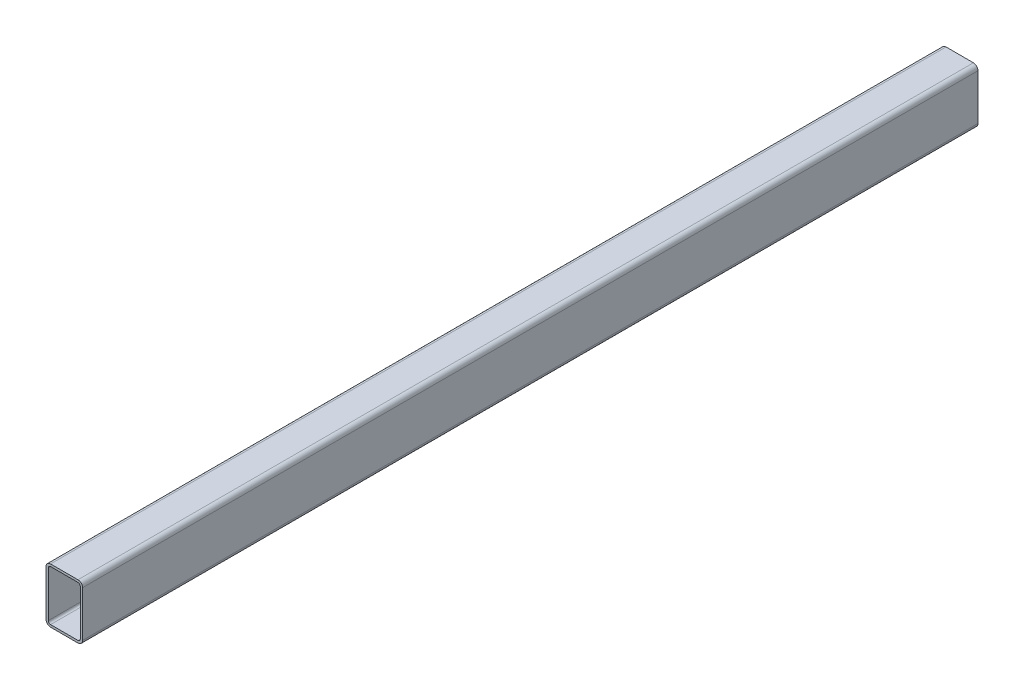
ISO-10303-21;
HEADER;
FILE_DESCRIPTION(('STEP AP214'),'2;1');
FILE_NAME('part.step','',(''),(''),'','','');
FILE_SCHEMA(('AUTOMOTIVE_DESIGN { 1 0 10303 214 1 1 1 1 }'));
ENDSEC;
DATA;
#1=APPLICATION_CONTEXT('core data for automotive mechanical design processes');
#2=APPLICATION_PROTOCOL_DEFINITION('international standard','automotive_design',2000,#1);
#3=PRODUCT_CONTEXT('',#1,'mechanical');
#4=PRODUCT('Part','Part','',(#3));
#5=PRODUCT_RELATED_PRODUCT_CATEGORY('part','',(#4));
#6=PRODUCT_DEFINITION_FORMATION('','',#4);
#7=PRODUCT_DEFINITION_CONTEXT('part definition',#1,'design');
#8=PRODUCT_DEFINITION('design','',#6,#7);
#9=PRODUCT_DEFINITION_SHAPE('','',#8);
#10=(LENGTH_UNIT() NAMED_UNIT(*) SI_UNIT(.MILLI.,.METRE.));
#11=(NAMED_UNIT(*) PLANE_ANGLE_UNIT() SI_UNIT($,.RADIAN.));
#12=(NAMED_UNIT(*) SI_UNIT($,.STERADIAN.) SOLID_ANGLE_UNIT());
#13=UNCERTAINTY_MEASURE_WITH_UNIT(LENGTH_MEASURE(1.E-05),#10,'distance_accuracy_value','');
#14=(GEOMETRIC_REPRESENTATION_CONTEXT(3) GLOBAL_UNCERTAINTY_ASSIGNED_CONTEXT((#13)) GLOBAL_UNIT_ASSIGNED_CONTEXT((#10,
#11,#12)) REPRESENTATION_CONTEXT('',''));
#15=CARTESIAN_POINT('',(0.,0.,0.));
#16=DIRECTION('',(0.,0.,1.));
#17=DIRECTION('',(1.,0.,0.));
#18=AXIS2_PLACEMENT_3D('',#15,#16,#17);
#19=CARTESIAN_POINT('',(-19.05,-31.75,622.3));
#20=DIRECTION('',(0.,0.,1.));
#21=DIRECTION('',(1.,0.,0.));
#22=AXIS2_PLACEMENT_3D('',#19,#20,#21);
#23=PLANE('',#22);
#24=CARTESIAN_POINT('',(-19.05,-31.75,622.3));
#25=DIRECTION('',(0.,0.,1.));
#26=DIRECTION('',(1.,0.,0.));
#27=AXIS2_PLACEMENT_3D('',#24,#25,#26);
#28=CIRCLE('',#27,6.35000000000001);
#29=CARTESIAN_POINT('',(-25.4,-31.75,622.3));
#30=VERTEX_POINT('',#29);
#31=CARTESIAN_POINT('',(-19.05,-38.1,622.3));
#32=VERTEX_POINT('',#31);
#33=EDGE_CURVE('E213',#30,#32,#28,.T.);
#34=ORIENTED_EDGE('',*,*,#33,.T.);
#35=DIRECTION('',(1.,0.,0.));
#36=VECTOR('',#35,1.);
#37=CARTESIAN_POINT('',(19.05,-38.1,622.3));
#38=LINE('',#37,#36);
#39=CARTESIAN_POINT('',(19.05,-38.1,622.3));
#40=VERTEX_POINT('',#39);
#41=EDGE_CURVE('E216',#32,#40,#38,.T.);
#42=ORIENTED_EDGE('',*,*,#41,.T.);
#43=CARTESIAN_POINT('',(19.05,-31.75,622.3));
#44=DIRECTION('',(0.,0.,1.));
#45=DIRECTION('',(1.,0.,0.));
#46=AXIS2_PLACEMENT_3D('',#43,#44,#45);
#47=CIRCLE('',#46,6.35);
#48=CARTESIAN_POINT('',(25.4,-31.75,622.3));
#49=VERTEX_POINT('',#48);
#50=EDGE_CURVE('E219',#40,#49,#47,.T.);
#51=ORIENTED_EDGE('',*,*,#50,.T.);
#52=DIRECTION('',(0.,1.,0.));
#53=VECTOR('',#52,1.);
#54=CARTESIAN_POINT('',(25.4,31.75,622.3));
#55=LINE('',#54,#53);
#56=CARTESIAN_POINT('',(25.4,31.75,622.3));
#57=VERTEX_POINT('',#56);
#58=EDGE_CURVE('E221',#49,#57,#55,.T.);
#59=ORIENTED_EDGE('',*,*,#58,.T.);
#60=CARTESIAN_POINT('',(19.05,31.75,622.3));
#61=DIRECTION('',(0.,0.,1.));
#62=DIRECTION('',(1.,0.,0.));
#63=AXIS2_PLACEMENT_3D('',#60,#61,#62);
#64=CIRCLE('',#63,6.35);
#65=CARTESIAN_POINT('',(19.05,38.1,622.3));
#66=VERTEX_POINT('',#65);
#67=EDGE_CURVE('E223',#57,#66,#64,.T.);
#68=ORIENTED_EDGE('',*,*,#67,.T.);
#69=DIRECTION('',(-1.,0.,0.));
#70=VECTOR('',#69,1.);
#71=CARTESIAN_POINT('',(-19.05,38.1,622.3));
#72=LINE('',#71,#70);
#73=CARTESIAN_POINT('',(-19.05,38.1,622.3));
#74=VERTEX_POINT('',#73);
#75=EDGE_CURVE('E225',#66,#74,#72,.T.);
#76=ORIENTED_EDGE('',*,*,#75,.T.);
#77=CARTESIAN_POINT('',(-19.05,31.75,622.3));
#78=DIRECTION('',(0.,0.,1.));
#79=DIRECTION('',(1.,0.,0.));
#80=AXIS2_PLACEMENT_3D('',#77,#78,#79);
#81=CIRCLE('',#80,6.35);
#82=CARTESIAN_POINT('',(-25.4,31.75,622.3));
#83=VERTEX_POINT('',#82);
#84=EDGE_CURVE('E227',#74,#83,#81,.T.);
#85=ORIENTED_EDGE('',*,*,#84,.T.);
#86=DIRECTION('',(0.,-1.,0.));
#87=VECTOR('',#86,1.);
#88=CARTESIAN_POINT('',(-25.4,-31.75,622.3));
#89=LINE('',#88,#87);
#90=EDGE_CURVE('E229',#83,#30,#89,.T.);
#91=ORIENTED_EDGE('',*,*,#90,.T.);
#92=EDGE_LOOP('',(#34,#42,#51,#59,#68,#76,#85,#91));
#93=FACE_BOUND('',#92,.T.);
#94=DIRECTION('',(1.,0.,0.));
#95=VECTOR('',#94,1.);
#96=CARTESIAN_POINT('',(19.05,-34.925,622.3));
#97=LINE('',#96,#95);
#98=CARTESIAN_POINT('',(-19.05,-34.925,622.3));
#99=VERTEX_POINT('',#98);
#100=CARTESIAN_POINT('',(19.05,-34.925,622.3));
#101=VERTEX_POINT('',#100);
#102=EDGE_CURVE('E156',#99,#101,#97,.T.);
#103=ORIENTED_EDGE('',*,*,#102,.F.);
#104=CARTESIAN_POINT('',(-19.05,-31.75,622.3));
#105=DIRECTION('',(0.,0.,1.));
#106=DIRECTION('',(1.,0.,0.));
#107=AXIS2_PLACEMENT_3D('',#104,#105,#106);
#108=CIRCLE('',#107,3.17500000000001);
#109=CARTESIAN_POINT('',(-22.225,-31.75,622.3));
#110=VERTEX_POINT('',#109);
#111=EDGE_CURVE('E148',#110,#99,#108,.T.);
#112=ORIENTED_EDGE('',*,*,#111,.F.);
#113=DIRECTION('',(0.,-1.,0.));
#114=VECTOR('',#113,1.);
#115=CARTESIAN_POINT('',(-22.225,-31.75,622.3));
#116=LINE('',#115,#114);
#117=CARTESIAN_POINT('',(-22.225,31.75,622.3));
#118=VERTEX_POINT('',#117);
#119=EDGE_CURVE('E181',#118,#110,#116,.T.);
#120=ORIENTED_EDGE('',*,*,#119,.F.);
#121=CARTESIAN_POINT('',(-19.05,31.75,622.3));
#122=DIRECTION('',(0.,0.,1.));
#123=DIRECTION('',(1.,0.,0.));
#124=AXIS2_PLACEMENT_3D('',#121,#122,#123);
#125=CIRCLE('',#124,3.175);
#126=CARTESIAN_POINT('',(-19.05,34.925,622.3));
#127=VERTEX_POINT('',#126);
#128=EDGE_CURVE('E179',#127,#118,#125,.T.);
#129=ORIENTED_EDGE('',*,*,#128,.F.);
#130=DIRECTION('',(-1.,0.,0.));
#131=VECTOR('',#130,1.);
#132=CARTESIAN_POINT('',(-19.05,34.925,622.3));
#133=LINE('',#132,#131);
#134=CARTESIAN_POINT('',(19.05,34.925,622.3));
#135=VERTEX_POINT('',#134);
#136=EDGE_CURVE('E177',#135,#127,#133,.T.);
#137=ORIENTED_EDGE('',*,*,#136,.F.);
#138=CARTESIAN_POINT('',(19.05,31.75,622.3));
#139=DIRECTION('',(0.,0.,1.));
#140=DIRECTION('',(1.,0.,0.));
#141=AXIS2_PLACEMENT_3D('',#138,#139,#140);
#142=CIRCLE('',#141,3.175);
#143=CARTESIAN_POINT('',(22.225,31.75,622.3));
#144=VERTEX_POINT('',#143);
#145=EDGE_CURVE('E175',#144,#135,#142,.T.);
#146=ORIENTED_EDGE('',*,*,#145,.F.);
#147=DIRECTION('',(0.,1.,0.));
#148=VECTOR('',#147,1.);
#149=CARTESIAN_POINT('',(22.225,31.75,622.3));
#150=LINE('',#149,#148);
#151=CARTESIAN_POINT('',(22.225,-31.75,622.3));
#152=VERTEX_POINT('',#151);
#153=EDGE_CURVE('E171',#152,#144,#150,.T.);
#154=ORIENTED_EDGE('',*,*,#153,.F.);
#155=CARTESIAN_POINT('',(19.05,-31.75,622.3));
#156=DIRECTION('',(0.,0.,1.));
#157=DIRECTION('',(1.,0.,0.));
#158=AXIS2_PLACEMENT_3D('',#155,#156,#157);
#159=CIRCLE('',#158,3.17500000000001);
#160=EDGE_CURVE('E169',#101,#152,#159,.T.);
#161=ORIENTED_EDGE('',*,*,#160,.F.);
#162=EDGE_LOOP('',(#103,#112,#120,#129,#137,#146,#154,#161));
#163=FACE_BOUND('',#162,.T.);
#164=ADVANCED_FACE('F35',(#93,#163),#23,.T.);
#165=CARTESIAN_POINT('',(-19.05,-31.75,-622.3));
#166=DIRECTION('',(0.,0.,1.));
#167=DIRECTION('',(1.,0.,0.));
#168=AXIS2_PLACEMENT_3D('',#165,#166,#167);
#169=PLANE('',#168);
#170=CARTESIAN_POINT('',(-19.05,-31.75,-622.3));
#171=DIRECTION('',(0.,0.,1.));
#172=DIRECTION('',(1.,0.,0.));
#173=AXIS2_PLACEMENT_3D('',#170,#171,#172);
#174=CIRCLE('',#173,6.35000000000001);
#175=CARTESIAN_POINT('',(-25.4,-31.75,-622.3));
#176=VERTEX_POINT('',#175);
#177=CARTESIAN_POINT('',(-19.05,-38.1,-622.3));
#178=VERTEX_POINT('',#177);
#179=EDGE_CURVE('E164',#176,#178,#174,.T.);
#180=ORIENTED_EDGE('',*,*,#179,.F.);
#181=DIRECTION('',(0.,-1.,0.));
#182=VECTOR('',#181,1.);
#183=CARTESIAN_POINT('',(-25.4,-31.75,-622.3));
#184=LINE('',#183,#182);
#185=CARTESIAN_POINT('',(-25.4,31.75,-622.3));
#186=VERTEX_POINT('',#185);
#187=EDGE_CURVE('E217',#186,#176,#184,.T.);
#188=ORIENTED_EDGE('',*,*,#187,.F.);
#189=CARTESIAN_POINT('',(-19.05,31.75,-622.3));
#190=DIRECTION('',(0.,0.,1.));
#191=DIRECTION('',(1.,0.,0.));
#192=AXIS2_PLACEMENT_3D('',#189,#190,#191);
#193=CIRCLE('',#192,6.35);
#194=CARTESIAN_POINT('',(-19.05,38.1,-622.3));
#195=VERTEX_POINT('',#194);
#196=EDGE_CURVE('E244',#195,#186,#193,.T.);
#197=ORIENTED_EDGE('',*,*,#196,.F.);
#198=DIRECTION('',(-1.,0.,0.));
#199=VECTOR('',#198,1.);
#200=CARTESIAN_POINT('',(-19.05,38.1,-622.3));
#201=LINE('',#200,#199);
#202=CARTESIAN_POINT('',(19.05,38.1,-622.3));
#203=VERTEX_POINT('',#202);
#204=EDGE_CURVE('E242',#203,#195,#201,.T.);
#205=ORIENTED_EDGE('',*,*,#204,.F.);
#206=CARTESIAN_POINT('',(19.05,31.75,-622.3));
#207=DIRECTION('',(0.,0.,1.));
#208=DIRECTION('',(1.,0.,0.));
#209=AXIS2_PLACEMENT_3D('',#206,#207,#208);
#210=CIRCLE('',#209,6.35);
#211=CARTESIAN_POINT('',(25.4,31.75,-622.3));
#212=VERTEX_POINT('',#211);
#213=EDGE_CURVE('E240',#212,#203,#210,.T.);
#214=ORIENTED_EDGE('',*,*,#213,.F.);
#215=DIRECTION('',(0.,1.,0.));
#216=VECTOR('',#215,1.);
#217=CARTESIAN_POINT('',(25.4,31.75,-622.3));
#218=LINE('',#217,#216);
#219=CARTESIAN_POINT('',(25.4,-31.75,-622.3));
#220=VERTEX_POINT('',#219);
#221=EDGE_CURVE('E238',#220,#212,#218,.T.);
#222=ORIENTED_EDGE('',*,*,#221,.F.);
#223=CARTESIAN_POINT('',(19.05,-31.75,-622.3));
#224=DIRECTION('',(0.,0.,1.));
#225=DIRECTION('',(1.,0.,0.));
#226=AXIS2_PLACEMENT_3D('',#223,#224,#225);
#227=CIRCLE('',#226,6.35);
#228=CARTESIAN_POINT('',(19.05,-38.1,-622.3));
#229=VERTEX_POINT('',#228);
#230=EDGE_CURVE('E236',#229,#220,#227,.T.);
#231=ORIENTED_EDGE('',*,*,#230,.F.);
#232=DIRECTION('',(1.,0.,0.));
#233=VECTOR('',#232,1.);
#234=CARTESIAN_POINT('',(19.05,-38.1,-622.3));
#235=LINE('',#234,#233);
#236=EDGE_CURVE('E234',#178,#229,#235,.T.);
#237=ORIENTED_EDGE('',*,*,#236,.F.);
#238=EDGE_LOOP('',(#180,#188,#197,#205,#214,#222,#231,#237));
#239=FACE_BOUND('',#238,.T.);
#240=CARTESIAN_POINT('',(-19.05,-31.75,-622.3));
#241=DIRECTION('',(0.,0.,1.));
#242=DIRECTION('',(1.,0.,0.));
#243=AXIS2_PLACEMENT_3D('',#240,#241,#242);
#244=CIRCLE('',#243,3.17500000000001);
#245=CARTESIAN_POINT('',(-22.225,-31.75,-622.3));
#246=VERTEX_POINT('',#245);
#247=CARTESIAN_POINT('',(-19.05,-34.925,-622.3));
#248=VERTEX_POINT('',#247);
#249=EDGE_CURVE('E58',#246,#248,#244,.T.);
#250=ORIENTED_EDGE('',*,*,#249,.T.);
#251=DIRECTION('',(1.,0.,0.));
#252=VECTOR('',#251,1.);
#253=CARTESIAN_POINT('',(19.05,-34.925,-622.3));
#254=LINE('',#253,#252);
#255=CARTESIAN_POINT('',(19.05,-34.925,-622.3));
#256=VERTEX_POINT('',#255);
#257=EDGE_CURVE('E163',#248,#256,#254,.T.);
#258=ORIENTED_EDGE('',*,*,#257,.T.);
#259=CARTESIAN_POINT('',(19.05,-31.75,-622.3));
#260=DIRECTION('',(0.,0.,1.));
#261=DIRECTION('',(1.,0.,0.));
#262=AXIS2_PLACEMENT_3D('',#259,#260,#261);
#263=CIRCLE('',#262,3.17500000000001);
#264=CARTESIAN_POINT('',(22.225,-31.75,-622.3));
#265=VERTEX_POINT('',#264);
#266=EDGE_CURVE('E185',#256,#265,#263,.T.);
#267=ORIENTED_EDGE('',*,*,#266,.T.);
#268=DIRECTION('',(0.,1.,0.));
#269=VECTOR('',#268,1.);
#270=CARTESIAN_POINT('',(22.225,31.75,-622.3));
#271=LINE('',#270,#269);
#272=CARTESIAN_POINT('',(22.225,31.75,-622.3));
#273=VERTEX_POINT('',#272);
#274=EDGE_CURVE('E188',#265,#273,#271,.T.);
#275=ORIENTED_EDGE('',*,*,#274,.T.);
#276=CARTESIAN_POINT('',(19.05,31.75,-622.3));
#277=DIRECTION('',(0.,0.,1.));
#278=DIRECTION('',(1.,0.,0.));
#279=AXIS2_PLACEMENT_3D('',#276,#277,#278);
#280=CIRCLE('',#279,3.175);
#281=CARTESIAN_POINT('',(19.05,34.925,-622.3));
#282=VERTEX_POINT('',#281);
#283=EDGE_CURVE('E191',#273,#282,#280,.T.);
#284=ORIENTED_EDGE('',*,*,#283,.T.);
#285=DIRECTION('',(-1.,0.,0.));
#286=VECTOR('',#285,1.);
#287=CARTESIAN_POINT('',(-19.05,34.925,-622.3));
#288=LINE('',#287,#286);
#289=CARTESIAN_POINT('',(-19.05,34.925,-622.3));
#290=VERTEX_POINT('',#289);
#291=EDGE_CURVE('E194',#282,#290,#288,.T.);
#292=ORIENTED_EDGE('',*,*,#291,.T.);
#293=CARTESIAN_POINT('',(-19.05,31.75,-622.3));
#294=DIRECTION('',(0.,0.,1.));
#295=DIRECTION('',(1.,0.,0.));
#296=AXIS2_PLACEMENT_3D('',#293,#294,#295);
#297=CIRCLE('',#296,3.175);
#298=CARTESIAN_POINT('',(-22.225,31.75,-622.3));
#299=VERTEX_POINT('',#298);
#300=EDGE_CURVE('E197',#290,#299,#297,.T.);
#301=ORIENTED_EDGE('',*,*,#300,.T.);
#302=DIRECTION('',(0.,-1.,0.));
#303=VECTOR('',#302,1.);
#304=CARTESIAN_POINT('',(-22.225,-31.75,-622.3));
#305=LINE('',#304,#303);
#306=EDGE_CURVE('E157',#299,#246,#305,.T.);
#307=ORIENTED_EDGE('',*,*,#306,.T.);
#308=EDGE_LOOP('',(#250,#258,#267,#275,#284,#292,#301,#307));
#309=FACE_BOUND('',#308,.T.);
#310=ADVANCED_FACE('F274',(#239,#309),#169,.F.);
#311=CARTESIAN_POINT('',(-19.05,-31.75,622.3));
#312=DIRECTION('',(0.,0.,-1.));
#313=DIRECTION('',(-1.,0.,0.));
#314=AXIS2_PLACEMENT_3D('',#311,#312,#313);
#315=CYLINDRICAL_SURFACE('',#314,6.35000000000001);
#316=ORIENTED_EDGE('',*,*,#179,.T.);
#317=DIRECTION('',(0.,0.,-1.));
#318=VECTOR('',#317,1.);
#319=CARTESIAN_POINT('',(-19.05,-38.1,622.3));
#320=LINE('',#319,#318);
#321=EDGE_CURVE('E11',#32,#178,#320,.T.);
#322=ORIENTED_EDGE('',*,*,#321,.F.);
#323=ORIENTED_EDGE('',*,*,#33,.F.);
#324=DIRECTION('',(0.,0.,-1.));
#325=VECTOR('',#324,1.);
#326=CARTESIAN_POINT('',(-25.4,-31.75,622.3));
#327=LINE('',#326,#325);
#328=EDGE_CURVE('E231',#30,#176,#327,.T.);
#329=ORIENTED_EDGE('',*,*,#328,.T.);
#330=EDGE_LOOP('',(#316,#322,#323,#329));
#331=FACE_BOUND('',#330,.T.);
#332=ADVANCED_FACE('F37',(#331),#315,.T.);
#333=CARTESIAN_POINT('',(19.05,-38.1,622.3));
#334=DIRECTION('',(0.,1.,0.));
#335=DIRECTION('',(-1.,0.,0.));
#336=AXIS2_PLACEMENT_3D('',#333,#334,#335);
#337=PLANE('',#336);
#338=ORIENTED_EDGE('',*,*,#236,.T.);
#339=DIRECTION('',(0.,0.,-1.));
#340=VECTOR('',#339,1.);
#341=CARTESIAN_POINT('',(19.05,-38.1,622.3));
#342=LINE('',#341,#340);
#343=EDGE_CURVE('E43',#40,#229,#342,.T.);
#344=ORIENTED_EDGE('',*,*,#343,.F.);
#345=ORIENTED_EDGE('',*,*,#41,.F.);
#346=ORIENTED_EDGE('',*,*,#321,.T.);
#347=EDGE_LOOP('',(#338,#344,#345,#346));
#348=FACE_BOUND('',#347,.T.);
#349=ADVANCED_FACE('F291',(#348),#337,.F.);
#350=CARTESIAN_POINT('',(19.05,-31.75,622.3));
#351=DIRECTION('',(0.,0.,-1.));
#352=DIRECTION('',(-1.,0.,0.));
#353=AXIS2_PLACEMENT_3D('',#350,#351,#352);
#354=CYLINDRICAL_SURFACE('',#353,6.35);
#355=ORIENTED_EDGE('',*,*,#230,.T.);
#356=DIRECTION('',(0.,0.,-1.));
#357=VECTOR('',#356,1.);
#358=CARTESIAN_POINT('',(25.4,-31.75,622.3));
#359=LINE('',#358,#357);
#360=EDGE_CURVE('E261',#49,#220,#359,.T.);
#361=ORIENTED_EDGE('',*,*,#360,.F.);
#362=ORIENTED_EDGE('',*,*,#50,.F.);
#363=ORIENTED_EDGE('',*,*,#343,.T.);
#364=EDGE_LOOP('',(#355,#361,#362,#363));
#365=FACE_BOUND('',#364,.T.);
#366=ADVANCED_FACE('F268',(#365),#354,.T.);
#367=CARTESIAN_POINT('',(25.4,31.75,622.3));
#368=DIRECTION('',(-1.,0.,0.));
#369=DIRECTION('',(0.,-1.,0.));
#370=AXIS2_PLACEMENT_3D('',#367,#368,#369);
#371=PLANE('',#370);
#372=ORIENTED_EDGE('',*,*,#221,.T.);
#373=DIRECTION('',(0.,0.,-1.));
#374=VECTOR('',#373,1.);
#375=CARTESIAN_POINT('',(25.4,31.75,622.3));
#376=LINE('',#375,#374);
#377=EDGE_CURVE('E258',#57,#212,#376,.T.);
#378=ORIENTED_EDGE('',*,*,#377,.F.);
#379=ORIENTED_EDGE('',*,*,#58,.F.);
#380=ORIENTED_EDGE('',*,*,#360,.T.);
#381=EDGE_LOOP('',(#372,#378,#379,#380));
#382=FACE_BOUND('',#381,.T.);
#383=ADVANCED_FACE('F280',(#382),#371,.F.);
#384=CARTESIAN_POINT('',(19.05,31.75,622.3));
#385=DIRECTION('',(0.,0.,-1.));
#386=DIRECTION('',(-1.,0.,0.));
#387=AXIS2_PLACEMENT_3D('',#384,#385,#386);
#388=CYLINDRICAL_SURFACE('',#387,6.35);
#389=ORIENTED_EDGE('',*,*,#213,.T.);
#390=DIRECTION('',(0.,0.,-1.));
#391=VECTOR('',#390,1.);
#392=CARTESIAN_POINT('',(19.05,38.1,622.3));
#393=LINE('',#392,#391);
#394=EDGE_CURVE('E255',#66,#203,#393,.T.);
#395=ORIENTED_EDGE('',*,*,#394,.F.);
#396=ORIENTED_EDGE('',*,*,#67,.F.);
#397=ORIENTED_EDGE('',*,*,#377,.T.);
#398=EDGE_LOOP('',(#389,#395,#396,#397));
#399=FACE_BOUND('',#398,.T.);
#400=ADVANCED_FACE('F284',(#399),#388,.T.);
#401=CARTESIAN_POINT('',(-19.05,38.1,622.3));
#402=DIRECTION('',(0.,-1.,0.));
#403=DIRECTION('',(0.,0.,-1.));
#404=AXIS2_PLACEMENT_3D('',#401,#402,#403);
#405=PLANE('',#404);
#406=ORIENTED_EDGE('',*,*,#204,.T.);
#407=DIRECTION('',(0.,0.,-1.));
#408=VECTOR('',#407,1.);
#409=CARTESIAN_POINT('',(-19.05,38.1,622.3));
#410=LINE('',#409,#408);
#411=EDGE_CURVE('E252',#74,#195,#410,.T.);
#412=ORIENTED_EDGE('',*,*,#411,.F.);
#413=ORIENTED_EDGE('',*,*,#75,.F.);
#414=ORIENTED_EDGE('',*,*,#394,.T.);
#415=EDGE_LOOP('',(#406,#412,#413,#414));
#416=FACE_BOUND('',#415,.T.);
#417=ADVANCED_FACE('F304',(#416),#405,.F.);
#418=CARTESIAN_POINT('',(-19.05,31.75,622.3));
#419=DIRECTION('',(0.,0.,-1.));
#420=DIRECTION('',(-1.,0.,0.));
#421=AXIS2_PLACEMENT_3D('',#418,#419,#420);
#422=CYLINDRICAL_SURFACE('',#421,6.35);
#423=ORIENTED_EDGE('',*,*,#196,.T.);
#424=DIRECTION('',(0.,0.,-1.));
#425=VECTOR('',#424,1.);
#426=CARTESIAN_POINT('',(-25.4,31.75,622.3));
#427=LINE('',#426,#425);
#428=EDGE_CURVE('E249',#83,#186,#427,.T.);
#429=ORIENTED_EDGE('',*,*,#428,.F.);
#430=ORIENTED_EDGE('',*,*,#84,.F.);
#431=ORIENTED_EDGE('',*,*,#411,.T.);
#432=EDGE_LOOP('',(#423,#429,#430,#431));
#433=FACE_BOUND('',#432,.T.);
#434=ADVANCED_FACE('F302',(#433),#422,.T.);
#435=CARTESIAN_POINT('',(-25.4,-31.75,622.3));
#436=DIRECTION('',(1.,0.,0.));
#437=DIRECTION('',(0.,1.,0.));
#438=AXIS2_PLACEMENT_3D('',#435,#436,#437);
#439=PLANE('',#438);
#440=ORIENTED_EDGE('',*,*,#187,.T.);
#441=ORIENTED_EDGE('',*,*,#328,.F.);
#442=ORIENTED_EDGE('',*,*,#90,.F.);
#443=ORIENTED_EDGE('',*,*,#428,.T.);
#444=EDGE_LOOP('',(#440,#441,#442,#443));
#445=FACE_BOUND('',#444,.T.);
#446=ADVANCED_FACE('F297',(#445),#439,.F.);
#447=CARTESIAN_POINT('',(-19.05,-31.75,622.3));
#448=DIRECTION('',(0.,0.,-1.));
#449=DIRECTION('',(-1.,0.,0.));
#450=AXIS2_PLACEMENT_3D('',#447,#448,#449);
#451=CYLINDRICAL_SURFACE('',#450,3.17500000000001);
#452=ORIENTED_EDGE('',*,*,#249,.F.);
#453=DIRECTION('',(0.,0.,-1.));
#454=VECTOR('',#453,1.);
#455=CARTESIAN_POINT('',(-22.225,-31.75,622.3));
#456=LINE('',#455,#454);
#457=EDGE_CURVE('E152',#110,#246,#456,.T.);
#458=ORIENTED_EDGE('',*,*,#457,.F.);
#459=ORIENTED_EDGE('',*,*,#111,.T.);
#460=DIRECTION('',(0.,0.,-1.));
#461=VECTOR('',#460,1.);
#462=CARTESIAN_POINT('',(-19.05,-34.925,622.3));
#463=LINE('',#462,#461);
#464=EDGE_CURVE('E151',#99,#248,#463,.T.);
#465=ORIENTED_EDGE('',*,*,#464,.T.);
#466=EDGE_LOOP('',(#452,#458,#459,#465));
#467=FACE_BOUND('',#466,.T.);
#468=ADVANCED_FACE('F150',(#467),#451,.F.);
#469=CARTESIAN_POINT('',(19.05,-34.925,622.3));
#470=DIRECTION('',(0.,1.,0.));
#471=DIRECTION('',(0.,0.,1.));
#472=AXIS2_PLACEMENT_3D('',#469,#470,#471);
#473=PLANE('',#472);
#474=ORIENTED_EDGE('',*,*,#257,.F.);
#475=ORIENTED_EDGE('',*,*,#464,.F.);
#476=ORIENTED_EDGE('',*,*,#102,.T.);
#477=DIRECTION('',(0.,0.,-1.));
#478=VECTOR('',#477,1.);
#479=CARTESIAN_POINT('',(19.05,-34.925,622.3));
#480=LINE('',#479,#478);
#481=EDGE_CURVE('E165',#101,#256,#480,.T.);
#482=ORIENTED_EDGE('',*,*,#481,.T.);
#483=EDGE_LOOP('',(#474,#475,#476,#482));
#484=FACE_BOUND('',#483,.T.);
#485=ADVANCED_FACE('F160',(#484),#473,.T.);
#486=CARTESIAN_POINT('',(19.05,-31.75,622.3));
#487=DIRECTION('',(0.,0.,-1.));
#488=DIRECTION('',(-1.,0.,0.));
#489=AXIS2_PLACEMENT_3D('',#486,#487,#488);
#490=CYLINDRICAL_SURFACE('',#489,3.17500000000001);
#491=ORIENTED_EDGE('',*,*,#266,.F.);
#492=ORIENTED_EDGE('',*,*,#481,.F.);
#493=ORIENTED_EDGE('',*,*,#160,.T.);
#494=DIRECTION('',(0.,0.,-1.));
#495=VECTOR('',#494,1.);
#496=CARTESIAN_POINT('',(22.225,-31.75,622.3));
#497=LINE('',#496,#495);
#498=EDGE_CURVE('E210',#152,#265,#497,.T.);
#499=ORIENTED_EDGE('',*,*,#498,.T.);
#500=EDGE_LOOP('',(#491,#492,#493,#499));
#501=FACE_BOUND('',#500,.T.);
#502=ADVANCED_FACE('F329',(#501),#490,.F.);
#503=CARTESIAN_POINT('',(22.225,31.75,622.3));
#504=DIRECTION('',(-1.,0.,0.));
#505=DIRECTION('',(0.,-1.,0.));
#506=AXIS2_PLACEMENT_3D('',#503,#504,#505);
#507=PLANE('',#506);
#508=ORIENTED_EDGE('',*,*,#274,.F.);
#509=ORIENTED_EDGE('',*,*,#498,.F.);
#510=ORIENTED_EDGE('',*,*,#153,.T.);
#511=DIRECTION('',(0.,0.,-1.));
#512=VECTOR('',#511,1.);
#513=CARTESIAN_POINT('',(22.225,31.75,622.3));
#514=LINE('',#513,#512);
#515=EDGE_CURVE('E208',#144,#273,#514,.T.);
#516=ORIENTED_EDGE('',*,*,#515,.T.);
#517=EDGE_LOOP('',(#508,#509,#510,#516));
#518=FACE_BOUND('',#517,.T.);
#519=ADVANCED_FACE('F333',(#518),#507,.T.);
#520=CARTESIAN_POINT('',(19.05,31.75,622.3));
#521=DIRECTION('',(0.,0.,-1.));
#522=DIRECTION('',(-1.,0.,0.));
#523=AXIS2_PLACEMENT_3D('',#520,#521,#522);
#524=CYLINDRICAL_SURFACE('',#523,3.175);
#525=ORIENTED_EDGE('',*,*,#283,.F.);
#526=ORIENTED_EDGE('',*,*,#515,.F.);
#527=ORIENTED_EDGE('',*,*,#145,.T.);
#528=DIRECTION('',(0.,0.,-1.));
#529=VECTOR('',#528,1.);
#530=CARTESIAN_POINT('',(19.05,34.925,622.3));
#531=LINE('',#530,#529);
#532=EDGE_CURVE('E206',#135,#282,#531,.T.);
#533=ORIENTED_EDGE('',*,*,#532,.T.);
#534=EDGE_LOOP('',(#525,#526,#527,#533));
#535=FACE_BOUND('',#534,.T.);
#536=ADVANCED_FACE('F339',(#535),#524,.F.);
#537=CARTESIAN_POINT('',(-19.05,34.925,622.3));
#538=DIRECTION('',(0.,-1.,0.));
#539=DIRECTION('',(0.,0.,-1.));
#540=AXIS2_PLACEMENT_3D('',#537,#538,#539);
#541=PLANE('',#540);
#542=ORIENTED_EDGE('',*,*,#291,.F.);
#543=ORIENTED_EDGE('',*,*,#532,.F.);
#544=ORIENTED_EDGE('',*,*,#136,.T.);
#545=DIRECTION('',(0.,0.,-1.));
#546=VECTOR('',#545,1.);
#547=CARTESIAN_POINT('',(-19.05,34.925,622.3));
#548=LINE('',#547,#546);
#549=EDGE_CURVE('E204',#127,#290,#548,.T.);
#550=ORIENTED_EDGE('',*,*,#549,.T.);
#551=EDGE_LOOP('',(#542,#543,#544,#550));
#552=FACE_BOUND('',#551,.T.);
#553=ADVANCED_FACE('F343',(#552),#541,.T.);
#554=CARTESIAN_POINT('',(-19.05,31.75,622.3));
#555=DIRECTION('',(0.,0.,-1.));
#556=DIRECTION('',(-1.,0.,0.));
#557=AXIS2_PLACEMENT_3D('',#554,#555,#556);
#558=CYLINDRICAL_SURFACE('',#557,3.175);
#559=ORIENTED_EDGE('',*,*,#300,.F.);
#560=ORIENTED_EDGE('',*,*,#549,.F.);
#561=ORIENTED_EDGE('',*,*,#128,.T.);
#562=DIRECTION('',(0.,0.,-1.));
#563=VECTOR('',#562,1.);
#564=CARTESIAN_POINT('',(-22.225,31.75,622.3));
#565=LINE('',#564,#563);
#566=EDGE_CURVE('E50',#118,#299,#565,.T.);
#567=ORIENTED_EDGE('',*,*,#566,.T.);
#568=EDGE_LOOP('',(#559,#560,#561,#567));
#569=FACE_BOUND('',#568,.T.);
#570=ADVANCED_FACE('F347',(#569),#558,.F.);
#571=CARTESIAN_POINT('',(-22.225,-31.75,622.3));
#572=DIRECTION('',(1.,0.,0.));
#573=DIRECTION('',(0.,1.,0.));
#574=AXIS2_PLACEMENT_3D('',#571,#572,#573);
#575=PLANE('',#574);
#576=ORIENTED_EDGE('',*,*,#306,.F.);
#577=ORIENTED_EDGE('',*,*,#566,.F.);
#578=ORIENTED_EDGE('',*,*,#119,.T.);
#579=ORIENTED_EDGE('',*,*,#457,.T.);
#580=EDGE_LOOP('',(#576,#577,#578,#579));
#581=FACE_BOUND('',#580,.T.);
#582=ADVANCED_FACE('F351',(#581),#575,.T.);
#583=CLOSED_SHELL('',(#164,#310,#332,#349,#366,#383,#400,#417,#434,#446,#468,#485,#502,#519,
#536,#553,#570,#582));
#584=MANIFOLD_SOLID_BREP('B2',#583);
#585=ADVANCED_BREP_SHAPE_REPRESENTATION('',(#18,#584),#14);
#586=SHAPE_DEFINITION_REPRESENTATION(#9,#585);
ENDSEC;
END-ISO-10303-21;
